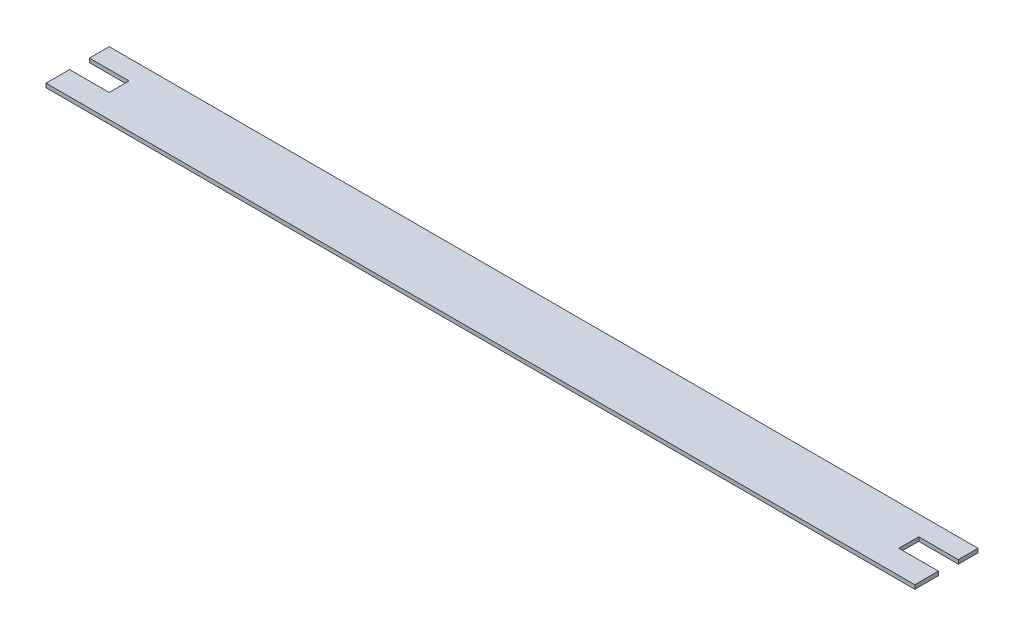
ISO-10303-21;
HEADER;
FILE_DESCRIPTION(('STEP AP214'),'2;1');
FILE_NAME('part.step','',(''),(''),'','','');
FILE_SCHEMA(('AUTOMOTIVE_DESIGN { 1 0 10303 214 1 1 1 1 }'));
ENDSEC;
DATA;
#1=APPLICATION_CONTEXT('core data for automotive mechanical design processes');
#2=APPLICATION_PROTOCOL_DEFINITION('international standard','automotive_design',2000,#1);
#3=PRODUCT_CONTEXT('',#1,'mechanical');
#4=PRODUCT('Part','Part','',(#3));
#5=PRODUCT_RELATED_PRODUCT_CATEGORY('part','',(#4));
#6=PRODUCT_DEFINITION_FORMATION('','',#4);
#7=PRODUCT_DEFINITION_CONTEXT('part definition',#1,'design');
#8=PRODUCT_DEFINITION('design','',#6,#7);
#9=PRODUCT_DEFINITION_SHAPE('','',#8);
#10=(LENGTH_UNIT() NAMED_UNIT(*) SI_UNIT(.MILLI.,.METRE.));
#11=(NAMED_UNIT(*) PLANE_ANGLE_UNIT() SI_UNIT($,.RADIAN.));
#12=(NAMED_UNIT(*) SI_UNIT($,.STERADIAN.) SOLID_ANGLE_UNIT());
#13=UNCERTAINTY_MEASURE_WITH_UNIT(LENGTH_MEASURE(1.E-05),#10,'distance_accuracy_value','');
#14=(GEOMETRIC_REPRESENTATION_CONTEXT(3) GLOBAL_UNCERTAINTY_ASSIGNED_CONTEXT((#13)) GLOBAL_UNIT_ASSIGNED_CONTEXT((#10,
#11,#12)) REPRESENTATION_CONTEXT('',''));
#15=CARTESIAN_POINT('',(0.,0.,0.));
#16=DIRECTION('',(0.,0.,1.));
#17=DIRECTION('',(1.,0.,0.));
#18=AXIS2_PLACEMENT_3D('',#15,#16,#17);
#19=CARTESIAN_POINT('',(597.266258042068,0.,0.));
#20=DIRECTION('',(-1.,0.,0.));
#21=DIRECTION('',(0.,0.,1.));
#22=AXIS2_PLACEMENT_3D('',#19,#20,#21);
#23=PLANE('',#22);
#24=DIRECTION('',(0.,0.,1.));
#25=VECTOR('',#24,1.);
#26=CARTESIAN_POINT('',(597.266258042068,-45.,0.));
#27=LINE('',#26,#25);
#28=CARTESIAN_POINT('',(597.266258042068,-45.,0.));
#29=VERTEX_POINT('',#28);
#30=CARTESIAN_POINT('',(597.266258042068,-45.,24.9));
#31=VERTEX_POINT('',#30);
#32=EDGE_CURVE('E235',#29,#31,#27,.T.);
#33=ORIENTED_EDGE('',*,*,#32,.T.);
#34=DIRECTION('',(0.,-1.,0.));
#35=VECTOR('',#34,1.);
#36=CARTESIAN_POINT('',(597.266258042068,0.,24.9));
#37=LINE('',#36,#35);
#38=CARTESIAN_POINT('',(597.266258042068,-50.,24.9));
#39=VERTEX_POINT('',#38);
#40=EDGE_CURVE('E185',#31,#39,#37,.T.);
#41=ORIENTED_EDGE('',*,*,#40,.T.);
#42=DIRECTION('',(0.,0.,-1.));
#43=VECTOR('',#42,1.);
#44=CARTESIAN_POINT('',(597.266258042068,-50.,80.));
#45=LINE('',#44,#43);
#46=CARTESIAN_POINT('',(597.266258042068,-50.,0.));
#47=VERTEX_POINT('',#46);
#48=EDGE_CURVE('E232',#39,#47,#45,.T.);
#49=ORIENTED_EDGE('',*,*,#48,.T.);
#50=DIRECTION('',(0.,-1.,0.));
#51=VECTOR('',#50,1.);
#52=CARTESIAN_POINT('',(597.266258042068,0.,0.));
#53=LINE('',#52,#51);
#54=EDGE_CURVE('E240',#29,#47,#53,.T.);
#55=ORIENTED_EDGE('',*,*,#54,.F.);
#56=EDGE_LOOP('',(#33,#41,#49,#55));
#57=FACE_BOUND('',#56,.T.);
#58=ADVANCED_FACE('F32',(#57),#23,.F.);
#59=CARTESIAN_POINT('',(-502.733741957931,0.,0.));
#60=DIRECTION('',(1.,0.,0.));
#61=DIRECTION('',(0.,0.,-1.));
#62=AXIS2_PLACEMENT_3D('',#59,#60,#61);
#63=PLANE('',#62);
#64=DIRECTION('',(0.,1.,0.));
#65=VECTOR('',#64,1.);
#66=CARTESIAN_POINT('',(-502.733741957931,0.,0.));
#67=LINE('',#66,#65);
#68=CARTESIAN_POINT('',(-502.733741957931,-50.,0.));
#69=VERTEX_POINT('',#68);
#70=CARTESIAN_POINT('',(-502.733741957931,-45.,0.));
#71=VERTEX_POINT('',#70);
#72=EDGE_CURVE('E231',#69,#71,#67,.T.);
#73=ORIENTED_EDGE('',*,*,#72,.F.);
#74=DIRECTION('',(0.,0.,-1.));
#75=VECTOR('',#74,1.);
#76=CARTESIAN_POINT('',(-502.733741957931,-50.,80.));
#77=LINE('',#76,#75);
#78=CARTESIAN_POINT('',(-502.733741957931,-50.,25.));
#79=VERTEX_POINT('',#78);
#80=EDGE_CURVE('E229',#79,#69,#77,.T.);
#81=ORIENTED_EDGE('',*,*,#80,.F.);
#82=DIRECTION('',(0.,-1.,0.));
#83=VECTOR('',#82,1.);
#84=CARTESIAN_POINT('',(-502.733741957931,-45.,25.));
#85=LINE('',#84,#83);
#86=CARTESIAN_POINT('',(-502.733741957931,-45.,25.));
#87=VERTEX_POINT('',#86);
#88=EDGE_CURVE('E188',#87,#79,#85,.T.);
#89=ORIENTED_EDGE('',*,*,#88,.F.);
#90=DIRECTION('',(0.,0.,-1.));
#91=VECTOR('',#90,1.);
#92=CARTESIAN_POINT('',(-502.733741957931,-45.,0.));
#93=LINE('',#92,#91);
#94=EDGE_CURVE('E238',#87,#71,#93,.T.);
#95=ORIENTED_EDGE('',*,*,#94,.T.);
#96=EDGE_LOOP('',(#73,#81,#89,#95));
#97=FACE_BOUND('',#96,.T.);
#98=ADVANCED_FACE('F262',(#97),#63,.F.);
#99=CARTESIAN_POINT('',(0.,-45.,0.));
#100=DIRECTION('',(0.,1.,0.));
#101=DIRECTION('',(0.,0.,1.));
#102=AXIS2_PLACEMENT_3D('',#99,#100,#101);
#103=PLANE('',#102);
#104=DIRECTION('',(-1.,0.,0.));
#105=VECTOR('',#104,1.);
#106=CARTESIAN_POINT('',(-502.733741957931,-45.,0.));
#107=LINE('',#106,#105);
#108=EDGE_CURVE('E213',#29,#71,#107,.T.);
#109=ORIENTED_EDGE('',*,*,#108,.T.);
#110=ORIENTED_EDGE('',*,*,#94,.F.);
#111=DIRECTION('',(-1.,0.,0.));
#112=VECTOR('',#111,1.);
#113=CARTESIAN_POINT('',(-452.733741957932,-45.,25.));
#114=LINE('',#113,#112);
#115=CARTESIAN_POINT('',(-452.733741957932,-45.,25.));
#116=VERTEX_POINT('',#115);
#117=EDGE_CURVE('E200',#116,#87,#114,.T.);
#118=ORIENTED_EDGE('',*,*,#117,.F.);
#119=DIRECTION('',(0.,0.,-1.));
#120=VECTOR('',#119,1.);
#121=CARTESIAN_POINT('',(-452.733741957932,-45.,25.));
#122=LINE('',#121,#120);
#123=CARTESIAN_POINT('',(-452.733741957932,-45.,25.0558642761631));
#124=VERTEX_POINT('',#123);
#125=EDGE_CURVE('E195',#124,#116,#122,.T.);
#126=ORIENTED_EDGE('',*,*,#125,.F.);
#127=DIRECTION('',(-1.,0.,0.));
#128=VECTOR('',#127,1.);
#129=CARTESIAN_POINT('',(0.,-45.,25.0558642761631));
#130=LINE('',#129,#128);
#131=CARTESIAN_POINT('',(-452.533741957932,-45.,25.0558642761631));
#132=VERTEX_POINT('',#131);
#133=EDGE_CURVE('E46',#132,#124,#130,.T.);
#134=ORIENTED_EDGE('',*,*,#133,.F.);
#135=DIRECTION('',(0.,0.,-1.));
#136=VECTOR('',#135,1.);
#137=CARTESIAN_POINT('',(-452.533741957932,-45.,0.));
#138=LINE('',#137,#136);
#139=CARTESIAN_POINT('',(-452.533741957932,-45.,50.2));
#140=VERTEX_POINT('',#139);
#141=EDGE_CURVE('E164',#140,#132,#138,.T.);
#142=ORIENTED_EDGE('',*,*,#141,.F.);
#143=DIRECTION('',(1.,0.,0.));
#144=VECTOR('',#143,1.);
#145=CARTESIAN_POINT('',(0.,-45.,50.2));
#146=LINE('',#145,#144);
#147=CARTESIAN_POINT('',(-502.733741957931,-45.,50.2));
#148=VERTEX_POINT('',#147);
#149=EDGE_CURVE('E139',#148,#140,#146,.T.);
#150=ORIENTED_EDGE('',*,*,#149,.F.);
#151=DIRECTION('',(0.,0.,1.));
#152=VECTOR('',#151,1.);
#153=CARTESIAN_POINT('',(-502.733741957931,-45.,80.));
#154=LINE('',#153,#152);
#155=CARTESIAN_POINT('',(-502.733741957931,-45.,80.));
#156=VERTEX_POINT('',#155);
#157=EDGE_CURVE('E203',#156,#148,#154,.F.);
#158=ORIENTED_EDGE('',*,*,#157,.F.);
#159=DIRECTION('',(1.,0.,0.));
#160=VECTOR('',#159,1.);
#161=CARTESIAN_POINT('',(-502.733741957931,-45.,80.));
#162=LINE('',#161,#160);
#163=CARTESIAN_POINT('',(597.266258042068,-45.,80.));
#164=VERTEX_POINT('',#163);
#165=EDGE_CURVE('E209',#156,#164,#162,.T.);
#166=ORIENTED_EDGE('',*,*,#165,.T.);
#167=DIRECTION('',(0.,0.,-1.));
#168=VECTOR('',#167,1.);
#169=CARTESIAN_POINT('',(597.266258042068,-45.,80.));
#170=LINE('',#169,#168);
#171=CARTESIAN_POINT('',(597.266258042068,-45.,50.1));
#172=VERTEX_POINT('',#171);
#173=EDGE_CURVE('E217',#164,#172,#170,.T.);
#174=ORIENTED_EDGE('',*,*,#173,.T.);
#175=DIRECTION('',(1.,0.,0.));
#176=VECTOR('',#175,1.);
#177=CARTESIAN_POINT('',(0.,-45.,50.1));
#178=LINE('',#177,#176);
#179=CARTESIAN_POINT('',(547.166258042068,-45.,50.1));
#180=VERTEX_POINT('',#179);
#181=EDGE_CURVE('E54',#180,#172,#178,.T.);
#182=ORIENTED_EDGE('',*,*,#181,.F.);
#183=DIRECTION('',(0.,0.,1.));
#184=VECTOR('',#183,1.);
#185=CARTESIAN_POINT('',(547.166258042068,-45.,0.));
#186=LINE('',#185,#184);
#187=CARTESIAN_POINT('',(547.166258042068,-45.,24.9));
#188=VERTEX_POINT('',#187);
#189=EDGE_CURVE('E181',#188,#180,#186,.T.);
#190=ORIENTED_EDGE('',*,*,#189,.F.);
#191=DIRECTION('',(-1.,0.,0.));
#192=VECTOR('',#191,1.);
#193=CARTESIAN_POINT('',(0.,-45.,24.9));
#194=LINE('',#193,#192);
#195=EDGE_CURVE('E183',#31,#188,#194,.T.);
#196=ORIENTED_EDGE('',*,*,#195,.F.);
#197=ORIENTED_EDGE('',*,*,#32,.F.);
#198=EDGE_LOOP('',(#109,#110,#118,#126,#134,#142,#150,#158,#166,#174,#182,#190,#196,#197));
#199=FACE_BOUND('',#198,.T.);
#200=ADVANCED_FACE('F257',(#199),#103,.T.);
#201=CARTESIAN_POINT('',(-502.733741957931,0.,0.));
#202=DIRECTION('',(0.,0.,1.));
#203=DIRECTION('',(1.,0.,0.));
#204=AXIS2_PLACEMENT_3D('',#201,#202,#203);
#205=PLANE('',#204);
#206=ORIENTED_EDGE('',*,*,#108,.F.);
#207=ORIENTED_EDGE('',*,*,#54,.T.);
#208=DIRECTION('',(1.,0.,0.));
#209=VECTOR('',#208,1.);
#210=CARTESIAN_POINT('',(-502.733741957931,-50.,0.));
#211=LINE('',#210,#209);
#212=EDGE_CURVE('E227',#69,#47,#211,.T.);
#213=ORIENTED_EDGE('',*,*,#212,.F.);
#214=ORIENTED_EDGE('',*,*,#72,.T.);
#215=EDGE_LOOP('',(#206,#207,#213,#214));
#216=FACE_BOUND('',#215,.T.);
#217=ADVANCED_FACE('F266',(#216),#205,.F.);
#218=CARTESIAN_POINT('',(-502.733741957931,-50.,80.));
#219=DIRECTION('',(0.,1.,0.));
#220=DIRECTION('',(0.,0.,1.));
#221=AXIS2_PLACEMENT_3D('',#218,#219,#220);
#222=PLANE('',#221);
#223=ORIENTED_EDGE('',*,*,#212,.T.);
#224=ORIENTED_EDGE('',*,*,#48,.F.);
#225=DIRECTION('',(-1.,0.,0.));
#226=VECTOR('',#225,1.);
#227=CARTESIAN_POINT('',(547.166258042068,-50.,24.9));
#228=LINE('',#227,#226);
#229=CARTESIAN_POINT('',(547.166258042068,-50.,24.9));
#230=VERTEX_POINT('',#229);
#231=EDGE_CURVE('E166',#39,#230,#228,.T.);
#232=ORIENTED_EDGE('',*,*,#231,.T.);
#233=DIRECTION('',(0.,0.,1.));
#234=VECTOR('',#233,1.);
#235=CARTESIAN_POINT('',(547.166258042068,-50.,24.9));
#236=LINE('',#235,#234);
#237=CARTESIAN_POINT('',(547.166258042068,-50.,50.1));
#238=VERTEX_POINT('',#237);
#239=EDGE_CURVE('E169',#230,#238,#236,.T.);
#240=ORIENTED_EDGE('',*,*,#239,.T.);
#241=DIRECTION('',(1.,0.,0.));
#242=VECTOR('',#241,1.);
#243=CARTESIAN_POINT('',(547.166258042068,-50.,50.1));
#244=LINE('',#243,#242);
#245=CARTESIAN_POINT('',(597.266258042068,-50.,50.1));
#246=VERTEX_POINT('',#245);
#247=EDGE_CURVE('E172',#238,#246,#244,.T.);
#248=ORIENTED_EDGE('',*,*,#247,.T.);
#249=DIRECTION('',(0.,0.,-1.));
#250=VECTOR('',#249,1.);
#251=CARTESIAN_POINT('',(597.266258042068,-50.,80.));
#252=LINE('',#251,#250);
#253=CARTESIAN_POINT('',(597.266258042068,-50.,80.));
#254=VERTEX_POINT('',#253);
#255=EDGE_CURVE('E210',#254,#246,#252,.T.);
#256=ORIENTED_EDGE('',*,*,#255,.F.);
#257=DIRECTION('',(1.,0.,0.));
#258=VECTOR('',#257,1.);
#259=CARTESIAN_POINT('',(-502.733741957931,-50.,80.));
#260=LINE('',#259,#258);
#261=CARTESIAN_POINT('',(-502.733741957931,-50.,80.));
#262=VERTEX_POINT('',#261);
#263=EDGE_CURVE('E220',#262,#254,#260,.T.);
#264=ORIENTED_EDGE('',*,*,#263,.F.);
#265=DIRECTION('',(0.,0.,-1.));
#266=VECTOR('',#265,1.);
#267=CARTESIAN_POINT('',(-502.733741957931,-50.,80.));
#268=LINE('',#267,#266);
#269=CARTESIAN_POINT('',(-502.733741957931,-50.,50.2));
#270=VERTEX_POINT('',#269);
#271=EDGE_CURVE('E157',#262,#270,#268,.T.);
#272=ORIENTED_EDGE('',*,*,#271,.T.);
#273=DIRECTION('',(1.,0.,0.));
#274=VECTOR('',#273,1.);
#275=CARTESIAN_POINT('',(-452.533741957932,-50.,50.2));
#276=LINE('',#275,#274);
#277=CARTESIAN_POINT('',(-452.533741957932,-50.,50.2));
#278=VERTEX_POINT('',#277);
#279=EDGE_CURVE('E137',#270,#278,#276,.T.);
#280=ORIENTED_EDGE('',*,*,#279,.T.);
#281=DIRECTION('',(0.,0.,-1.));
#282=VECTOR('',#281,1.);
#283=CARTESIAN_POINT('',(-452.533741957932,-50.,50.2));
#284=LINE('',#283,#282);
#285=CARTESIAN_POINT('',(-452.533741957932,-50.,25.0558642761631));
#286=VERTEX_POINT('',#285);
#287=EDGE_CURVE('E146',#278,#286,#284,.T.);
#288=ORIENTED_EDGE('',*,*,#287,.T.);
#289=DIRECTION('',(-1.,0.,0.));
#290=VECTOR('',#289,1.);
#291=CARTESIAN_POINT('',(-452.533741957932,-50.,25.0558642761631));
#292=LINE('',#291,#290);
#293=CARTESIAN_POINT('',(-452.733741957932,-50.,25.0558642761631));
#294=VERTEX_POINT('',#293);
#295=EDGE_CURVE('E143',#286,#294,#292,.T.);
#296=ORIENTED_EDGE('',*,*,#295,.T.);
#297=DIRECTION('',(0.,0.,1.));
#298=VECTOR('',#297,1.);
#299=CARTESIAN_POINT('',(-452.733741957932,-50.,25.));
#300=LINE('',#299,#298);
#301=CARTESIAN_POINT('',(-452.733741957932,-50.,25.));
#302=VERTEX_POINT('',#301);
#303=EDGE_CURVE('E192',#302,#294,#300,.T.);
#304=ORIENTED_EDGE('',*,*,#303,.F.);
#305=DIRECTION('',(-1.,0.,0.));
#306=VECTOR('',#305,1.);
#307=CARTESIAN_POINT('',(-452.733741957932,-50.,25.));
#308=LINE('',#307,#306);
#309=EDGE_CURVE('E197',#302,#79,#308,.T.);
#310=ORIENTED_EDGE('',*,*,#309,.T.);
#311=ORIENTED_EDGE('',*,*,#80,.T.);
#312=EDGE_LOOP('',(#223,#224,#232,#240,#248,#256,#264,#272,#280,#288,#296,#304,#310,#311));
#313=FACE_BOUND('',#312,.T.);
#314=ADVANCED_FACE('F154',(#313),#222,.F.);
#315=CARTESIAN_POINT('',(-502.733741957931,0.,80.));
#316=DIRECTION('',(0.,0.,1.));
#317=DIRECTION('',(1.,0.,0.));
#318=AXIS2_PLACEMENT_3D('',#315,#316,#317);
#319=PLANE('',#318);
#320=DIRECTION('',(0.,1.,0.));
#321=VECTOR('',#320,1.);
#322=CARTESIAN_POINT('',(-502.733741957931,0.,80.));
#323=LINE('',#322,#321);
#324=EDGE_CURVE('E206',#262,#156,#323,.T.);
#325=ORIENTED_EDGE('',*,*,#324,.F.);
#326=ORIENTED_EDGE('',*,*,#263,.T.);
#327=DIRECTION('',(0.,1.,0.));
#328=VECTOR('',#327,1.);
#329=CARTESIAN_POINT('',(597.266258042068,0.,80.));
#330=LINE('',#329,#328);
#331=EDGE_CURVE('E214',#254,#164,#330,.T.);
#332=ORIENTED_EDGE('',*,*,#331,.T.);
#333=ORIENTED_EDGE('',*,*,#165,.F.);
#334=EDGE_LOOP('',(#325,#326,#332,#333));
#335=FACE_BOUND('',#334,.T.);
#336=ADVANCED_FACE('F283',(#335),#319,.T.);
#337=ORIENTED_EDGE('',*,*,#157,.T.);
#338=DIRECTION('',(0.,-1.,0.));
#339=VECTOR('',#338,1.);
#340=CARTESIAN_POINT('',(-502.733741957931,0.,50.2));
#341=LINE('',#340,#339);
#342=EDGE_CURVE('E11',#148,#270,#341,.T.);
#343=ORIENTED_EDGE('',*,*,#342,.T.);
#344=ORIENTED_EDGE('',*,*,#271,.F.);
#345=ORIENTED_EDGE('',*,*,#324,.T.);
#346=EDGE_LOOP('',(#337,#343,#344,#345));
#347=FACE_BOUND('',#346,.T.);
#348=ADVANCED_FACE('F285',(#347),#63,.F.);
#349=CARTESIAN_POINT('',(597.266258042068,0.,0.));
#350=DIRECTION('',(1.,0.,0.));
#351=DIRECTION('',(0.,0.,-1.));
#352=AXIS2_PLACEMENT_3D('',#349,#350,#351);
#353=PLANE('',#352);
#354=DIRECTION('',(0.,-1.,0.));
#355=VECTOR('',#354,1.);
#356=CARTESIAN_POINT('',(597.266258042068,0.,50.1));
#357=LINE('',#356,#355);
#358=EDGE_CURVE('E234',#172,#246,#357,.T.);
#359=ORIENTED_EDGE('',*,*,#358,.F.);
#360=ORIENTED_EDGE('',*,*,#173,.F.);
#361=ORIENTED_EDGE('',*,*,#331,.F.);
#362=ORIENTED_EDGE('',*,*,#255,.T.);
#363=EDGE_LOOP('',(#359,#360,#361,#362));
#364=FACE_BOUND('',#363,.T.);
#365=ADVANCED_FACE('F280',(#364),#353,.T.);
#366=CARTESIAN_POINT('',(-452.733741957932,-45.,25.));
#367=DIRECTION('',(0.,0.,-1.));
#368=DIRECTION('',(-1.,0.,0.));
#369=AXIS2_PLACEMENT_3D('',#366,#367,#368);
#370=PLANE('',#369);
#371=ORIENTED_EDGE('',*,*,#88,.T.);
#372=ORIENTED_EDGE('',*,*,#309,.F.);
#373=DIRECTION('',(0.,-1.,0.));
#374=VECTOR('',#373,1.);
#375=CARTESIAN_POINT('',(-452.733741957932,-45.,25.));
#376=LINE('',#375,#374);
#377=EDGE_CURVE('E189',#116,#302,#376,.T.);
#378=ORIENTED_EDGE('',*,*,#377,.F.);
#379=ORIENTED_EDGE('',*,*,#117,.T.);
#380=EDGE_LOOP('',(#371,#372,#378,#379));
#381=FACE_BOUND('',#380,.T.);
#382=ADVANCED_FACE('F254',(#381),#370,.F.);
#383=CARTESIAN_POINT('',(-452.733741957932,0.,0.));
#384=DIRECTION('',(-1.,0.,0.));
#385=DIRECTION('',(0.,0.,1.));
#386=AXIS2_PLACEMENT_3D('',#383,#384,#385);
#387=PLANE('',#386);
#388=DIRECTION('',(0.,-1.,0.));
#389=VECTOR('',#388,1.);
#390=CARTESIAN_POINT('',(-452.733741957932,0.,25.0558642761631));
#391=LINE('',#390,#389);
#392=EDGE_CURVE('E39',#124,#294,#391,.T.);
#393=ORIENTED_EDGE('',*,*,#392,.F.);
#394=ORIENTED_EDGE('',*,*,#125,.T.);
#395=ORIENTED_EDGE('',*,*,#377,.T.);
#396=ORIENTED_EDGE('',*,*,#303,.T.);
#397=EDGE_LOOP('',(#393,#394,#395,#396));
#398=FACE_BOUND('',#397,.T.);
#399=ADVANCED_FACE('F250',(#398),#387,.T.);
#400=CARTESIAN_POINT('',(547.166258042068,-50.,24.9));
#401=DIRECTION('',(0.,0.,-1.));
#402=DIRECTION('',(-1.,0.,0.));
#403=AXIS2_PLACEMENT_3D('',#400,#401,#402);
#404=PLANE('',#403);
#405=ORIENTED_EDGE('',*,*,#195,.T.);
#406=DIRECTION('',(0.,1.,0.));
#407=VECTOR('',#406,1.);
#408=CARTESIAN_POINT('',(547.166258042068,-50.,24.9));
#409=LINE('',#408,#407);
#410=EDGE_CURVE('E175',#230,#188,#409,.T.);
#411=ORIENTED_EDGE('',*,*,#410,.F.);
#412=ORIENTED_EDGE('',*,*,#231,.F.);
#413=ORIENTED_EDGE('',*,*,#40,.F.);
#414=EDGE_LOOP('',(#405,#411,#412,#413));
#415=FACE_BOUND('',#414,.T.);
#416=ADVANCED_FACE('F272',(#415),#404,.F.);
#417=CARTESIAN_POINT('',(547.166258042068,-50.,50.1));
#418=DIRECTION('',(0.,0.,1.));
#419=DIRECTION('',(1.,0.,0.));
#420=AXIS2_PLACEMENT_3D('',#417,#418,#419);
#421=PLANE('',#420);
#422=ORIENTED_EDGE('',*,*,#181,.T.);
#423=ORIENTED_EDGE('',*,*,#358,.T.);
#424=ORIENTED_EDGE('',*,*,#247,.F.);
#425=DIRECTION('',(0.,1.,0.));
#426=VECTOR('',#425,1.);
#427=CARTESIAN_POINT('',(547.166258042068,-50.,50.1));
#428=LINE('',#427,#426);
#429=EDGE_CURVE('E176',#238,#180,#428,.T.);
#430=ORIENTED_EDGE('',*,*,#429,.T.);
#431=EDGE_LOOP('',(#422,#423,#424,#430));
#432=FACE_BOUND('',#431,.T.);
#433=ADVANCED_FACE('F312',(#432),#421,.F.);
#434=CARTESIAN_POINT('',(547.166258042068,-50.,24.9));
#435=DIRECTION('',(-1.,0.,0.));
#436=DIRECTION('',(0.,0.,1.));
#437=AXIS2_PLACEMENT_3D('',#434,#435,#436);
#438=PLANE('',#437);
#439=ORIENTED_EDGE('',*,*,#189,.T.);
#440=ORIENTED_EDGE('',*,*,#429,.F.);
#441=ORIENTED_EDGE('',*,*,#239,.F.);
#442=ORIENTED_EDGE('',*,*,#410,.T.);
#443=EDGE_LOOP('',(#439,#440,#441,#442));
#444=FACE_BOUND('',#443,.T.);
#445=ADVANCED_FACE('F275',(#444),#438,.F.);
#446=CARTESIAN_POINT('',(-452.533741957932,-50.,50.2));
#447=DIRECTION('',(0.,0.,1.));
#448=DIRECTION('',(1.,0.,0.));
#449=AXIS2_PLACEMENT_3D('',#446,#447,#448);
#450=PLANE('',#449);
#451=ORIENTED_EDGE('',*,*,#149,.T.);
#452=DIRECTION('',(0.,1.,0.));
#453=VECTOR('',#452,1.);
#454=CARTESIAN_POINT('',(-452.533741957932,-50.,50.2));
#455=LINE('',#454,#453);
#456=EDGE_CURVE('E133',#278,#140,#455,.T.);
#457=ORIENTED_EDGE('',*,*,#456,.F.);
#458=ORIENTED_EDGE('',*,*,#279,.F.);
#459=ORIENTED_EDGE('',*,*,#342,.F.);
#460=EDGE_LOOP('',(#451,#457,#458,#459));
#461=FACE_BOUND('',#460,.T.);
#462=ADVANCED_FACE('F135',(#461),#450,.F.);
#463=CARTESIAN_POINT('',(-452.533741957932,-50.,25.0558642761631));
#464=DIRECTION('',(0.,0.,-1.));
#465=DIRECTION('',(-1.,0.,0.));
#466=AXIS2_PLACEMENT_3D('',#463,#464,#465);
#467=PLANE('',#466);
#468=ORIENTED_EDGE('',*,*,#133,.T.);
#469=ORIENTED_EDGE('',*,*,#392,.T.);
#470=ORIENTED_EDGE('',*,*,#295,.F.);
#471=DIRECTION('',(0.,1.,0.));
#472=VECTOR('',#471,1.);
#473=CARTESIAN_POINT('',(-452.533741957932,-50.,25.0558642761631));
#474=LINE('',#473,#472);
#475=EDGE_CURVE('E142',#286,#132,#474,.T.);
#476=ORIENTED_EDGE('',*,*,#475,.T.);
#477=EDGE_LOOP('',(#468,#469,#470,#476));
#478=FACE_BOUND('',#477,.T.);
#479=ADVANCED_FACE('F246',(#478),#467,.F.);
#480=CARTESIAN_POINT('',(-452.533741957932,-50.,50.2));
#481=DIRECTION('',(1.,0.,0.));
#482=DIRECTION('',(0.,0.,-1.));
#483=AXIS2_PLACEMENT_3D('',#480,#481,#482);
#484=PLANE('',#483);
#485=ORIENTED_EDGE('',*,*,#141,.T.);
#486=ORIENTED_EDGE('',*,*,#475,.F.);
#487=ORIENTED_EDGE('',*,*,#287,.F.);
#488=ORIENTED_EDGE('',*,*,#456,.T.);
#489=EDGE_LOOP('',(#485,#486,#487,#488));
#490=FACE_BOUND('',#489,.T.);
#491=ADVANCED_FACE('F147',(#490),#484,.F.);
#492=CLOSED_SHELL('',(#58,#98,#200,#217,#314,#336,#348,#365,#382,#399,#416,#433,#445,#462,#479,#491));
#493=MANIFOLD_SOLID_BREP('B2',#492);
#494=ADVANCED_BREP_SHAPE_REPRESENTATION('',(#18,#493),#14);
#495=SHAPE_DEFINITION_REPRESENTATION(#9,#494);
ENDSEC;
END-ISO-10303-21;
